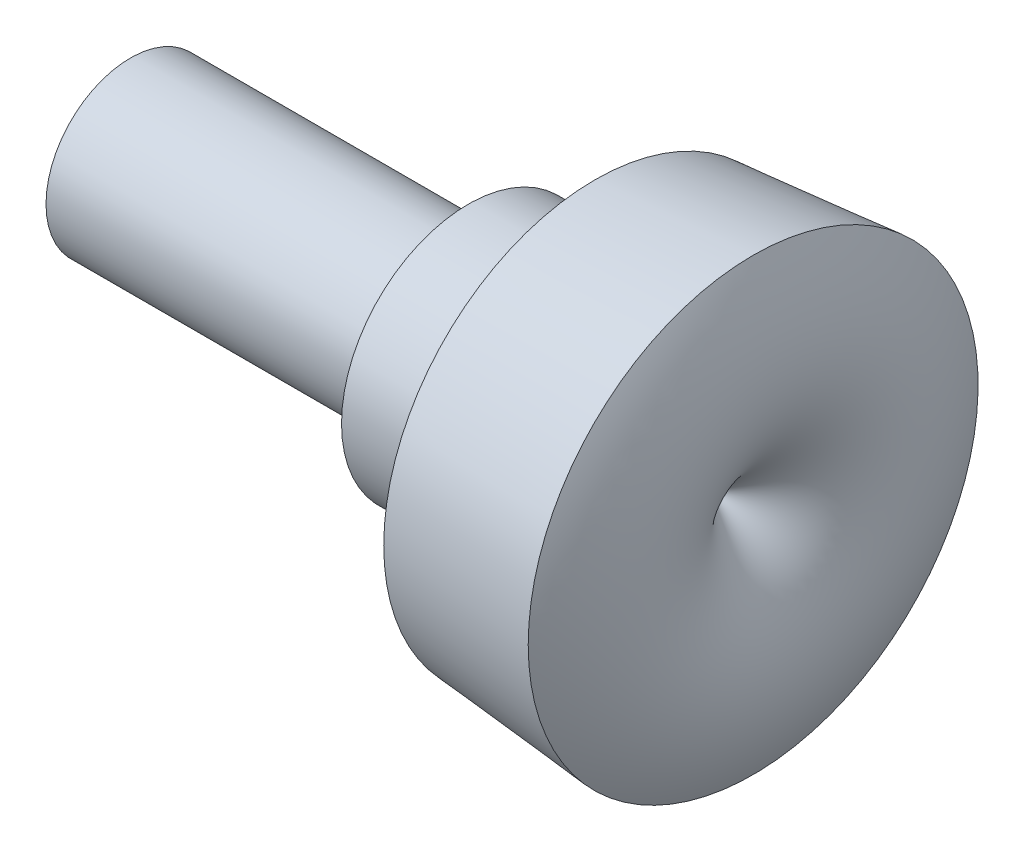
ISO-10303-21;
HEADER;
FILE_DESCRIPTION(('STEP AP214'),'2;1');
FILE_NAME('part.step','',(''),(''),'','','');
FILE_SCHEMA(('AUTOMOTIVE_DESIGN { 1 0 10303 214 1 1 1 1 }'));
ENDSEC;
DATA;
#1=APPLICATION_CONTEXT('core data for automotive mechanical design processes');
#2=APPLICATION_PROTOCOL_DEFINITION('international standard','automotive_design',2000,#1);
#3=PRODUCT_CONTEXT('',#1,'mechanical');
#4=PRODUCT('Part','Part','',(#3));
#5=PRODUCT_RELATED_PRODUCT_CATEGORY('part','',(#4));
#6=PRODUCT_DEFINITION_FORMATION('','',#4);
#7=PRODUCT_DEFINITION_CONTEXT('part definition',#1,'design');
#8=PRODUCT_DEFINITION('design','',#6,#7);
#9=PRODUCT_DEFINITION_SHAPE('','',#8);
#10=(LENGTH_UNIT() NAMED_UNIT(*) SI_UNIT(.MILLI.,.METRE.));
#11=(NAMED_UNIT(*) PLANE_ANGLE_UNIT() SI_UNIT($,.RADIAN.));
#12=(NAMED_UNIT(*) SI_UNIT($,.STERADIAN.) SOLID_ANGLE_UNIT());
#13=UNCERTAINTY_MEASURE_WITH_UNIT(LENGTH_MEASURE(1.E-05),#10,'distance_accuracy_value','');
#14=(GEOMETRIC_REPRESENTATION_CONTEXT(3) GLOBAL_UNCERTAINTY_ASSIGNED_CONTEXT((#13)) GLOBAL_UNIT_ASSIGNED_CONTEXT((#10,
#11,#12)) REPRESENTATION_CONTEXT('',''));
#15=CARTESIAN_POINT('',(0.,0.,0.));
#16=DIRECTION('',(0.,0.,1.));
#17=DIRECTION('',(1.,0.,0.));
#18=AXIS2_PLACEMENT_3D('',#15,#16,#17);
#19=CARTESIAN_POINT('',(13.75,0.,0.));
#20=CARTESIAN_POINT('',(16.478433803921,2.10117274694767,0.));
#21=CARTESIAN_POINT('',(14.75,5.3280824882222,0.));
#22=B_SPLINE_CURVE_WITH_KNOTS('',2,(#19,#20,#21),.UNSPECIFIED.,.F.,.F.,(3,3),(0.,1.),.UNSPECIFIED.);
#23=CARTESIAN_POINT('',(0.,0.,0.));
#24=DIRECTION('',(-1.,0.,0.));
#25=AXIS1_PLACEMENT('',#23,#24);
#26=SURFACE_OF_REVOLUTION('',#22,#25);
#27=CARTESIAN_POINT('',(14.75,0.,0.));
#28=DIRECTION('',(-1.,0.,0.));
#29=DIRECTION('',(0.,0.,1.));
#30=AXIS2_PLACEMENT_3D('',#27,#28,#29);
#31=CIRCLE('',#30,5.3280824882222);
#32=CARTESIAN_POINT('',(14.75,0.,5.3280824882222));
#33=VERTEX_POINT('',#32);
#34=EDGE_CURVE('E11',#33,#33,#31,.T.);
#35=ORIENTED_EDGE('',*,*,#34,.F.);
#36=EDGE_LOOP('',(#35));
#37=FACE_BOUND('',#36,.T.);
#38=CARTESIAN_POINT('',(13.75,0.,0.));
#39=VERTEX_POINT('',#38);
#40=VERTEX_LOOP('',#39);
#41=FACE_BOUND('',#40,.T.);
#42=ADVANCED_FACE('F32',(#37,#41),#26,.T.);
#43=CARTESIAN_POINT('',(14.75,0.,0.));
#44=DIRECTION('',(1.,0.,0.));
#45=DIRECTION('',(0.,0.,-1.));
#46=AXIS2_PLACEMENT_3D('',#43,#44,#45);
#47=CONICAL_SURFACE('',#46,5.3280824882222,0.0872664625997132);
#48=CARTESIAN_POINT('',(11.,0.,0.));
#49=DIRECTION('',(-1.,0.,0.));
#50=DIRECTION('',(0.,0.,1.));
#51=AXIS2_PLACEMENT_3D('',#48,#49,#50);
#52=CIRCLE('',#51,5.);
#53=CARTESIAN_POINT('',(11.,0.,5.));
#54=VERTEX_POINT('',#53);
#55=EDGE_CURVE('E39',#54,#54,#52,.T.);
#56=ORIENTED_EDGE('',*,*,#55,.F.);
#57=EDGE_LOOP('',(#56));
#58=FACE_BOUND('',#57,.T.);
#59=ORIENTED_EDGE('',*,*,#34,.T.);
#60=EDGE_LOOP('',(#59));
#61=FACE_BOUND('',#60,.T.);
#62=ADVANCED_FACE('F43',(#58,#61),#47,.T.);
#63=CARTESIAN_POINT('',(11.,3.,0.));
#64=DIRECTION('',(1.,0.,0.));
#65=DIRECTION('',(0.,0.,-1.));
#66=AXIS2_PLACEMENT_3D('',#63,#64,#65);
#67=PLANE('',#66);
#68=CARTESIAN_POINT('',(11.,0.,0.));
#69=DIRECTION('',(-1.,0.,0.));
#70=DIRECTION('',(0.,0.,1.));
#71=AXIS2_PLACEMENT_3D('',#68,#69,#70);
#72=CIRCLE('',#71,3.);
#73=CARTESIAN_POINT('',(11.,0.,3.));
#74=VERTEX_POINT('',#73);
#75=EDGE_CURVE('E90',#74,#74,#72,.T.);
#76=ORIENTED_EDGE('',*,*,#75,.F.);
#77=EDGE_LOOP('',(#76));
#78=FACE_BOUND('',#77,.T.);
#79=ORIENTED_EDGE('',*,*,#55,.T.);
#80=EDGE_LOOP('',(#79));
#81=FACE_BOUND('',#80,.T.);
#82=ADVANCED_FACE('F48',(#78,#81),#67,.F.);
#83=CARTESIAN_POINT('',(0.,0.,0.));
#84=DIRECTION('',(-1.,0.,0.));
#85=DIRECTION('',(0.,0.,1.));
#86=AXIS2_PLACEMENT_3D('',#83,#84,#85);
#87=CYLINDRICAL_SURFACE('',#86,3.);
#88=CARTESIAN_POINT('',(8.,0.,0.));
#89=DIRECTION('',(-1.,0.,0.));
#90=DIRECTION('',(0.,0.,1.));
#91=AXIS2_PLACEMENT_3D('',#88,#89,#90);
#92=CIRCLE('',#91,3.);
#93=CARTESIAN_POINT('',(8.,0.,3.));
#94=VERTEX_POINT('',#93);
#95=EDGE_CURVE('E82',#94,#94,#92,.T.);
#96=ORIENTED_EDGE('',*,*,#95,.F.);
#97=EDGE_LOOP('',(#96));
#98=FACE_BOUND('',#97,.T.);
#99=ORIENTED_EDGE('',*,*,#75,.T.);
#100=EDGE_LOOP('',(#99));
#101=FACE_BOUND('',#100,.T.);
#102=ADVANCED_FACE('F55',(#98,#101),#87,.T.);
#103=CARTESIAN_POINT('',(8.,2.,0.));
#104=DIRECTION('',(1.,0.,0.));
#105=DIRECTION('',(0.,0.,-1.));
#106=AXIS2_PLACEMENT_3D('',#103,#104,#105);
#107=PLANE('',#106);
#108=CARTESIAN_POINT('',(8.00000000000001,0.,0.));
#109=DIRECTION('',(-1.,0.,0.));
#110=DIRECTION('',(0.,0.,1.));
#111=AXIS2_PLACEMENT_3D('',#108,#109,#110);
#112=CIRCLE('',#111,2.);
#113=CARTESIAN_POINT('',(8.00000000000001,0.,2.));
#114=VERTEX_POINT('',#113);
#115=EDGE_CURVE('E79',#114,#114,#112,.T.);
#116=ORIENTED_EDGE('',*,*,#115,.F.);
#117=EDGE_LOOP('',(#116));
#118=FACE_BOUND('',#117,.T.);
#119=ORIENTED_EDGE('',*,*,#95,.T.);
#120=EDGE_LOOP('',(#119));
#121=FACE_BOUND('',#120,.T.);
#122=ADVANCED_FACE('F62',(#118,#121),#107,.F.);
#123=CARTESIAN_POINT('',(0.,0.,0.));
#124=DIRECTION('',(-1.,0.,0.));
#125=DIRECTION('',(0.,0.,1.));
#126=AXIS2_PLACEMENT_3D('',#123,#124,#125);
#127=CYLINDRICAL_SURFACE('',#126,2.);
#128=CARTESIAN_POINT('',(0.,0.,0.));
#129=DIRECTION('',(-1.,0.,0.));
#130=DIRECTION('',(0.,0.,1.));
#131=AXIS2_PLACEMENT_3D('',#128,#129,#130);
#132=CIRCLE('',#131,2.);
#133=CARTESIAN_POINT('',(0.,0.,2.));
#134=VERTEX_POINT('',#133);
#135=EDGE_CURVE('E78',#134,#134,#132,.T.);
#136=ORIENTED_EDGE('',*,*,#135,.F.);
#137=EDGE_LOOP('',(#136));
#138=FACE_BOUND('',#137,.T.);
#139=ORIENTED_EDGE('',*,*,#115,.T.);
#140=EDGE_LOOP('',(#139));
#141=FACE_BOUND('',#140,.T.);
#142=ADVANCED_FACE('F66',(#138,#141),#127,.T.);
#143=CARTESIAN_POINT('',(0.,0.,0.));
#144=DIRECTION('',(1.,0.,0.));
#145=DIRECTION('',(0.,0.,-1.));
#146=AXIS2_PLACEMENT_3D('',#143,#144,#145);
#147=PLANE('',#146);
#148=ORIENTED_EDGE('',*,*,#135,.T.);
#149=EDGE_LOOP('',(#148));
#150=FACE_BOUND('',#149,.T.);
#151=ADVANCED_FACE('F70',(#150),#147,.F.);
#152=CLOSED_SHELL('',(#42,#62,#82,#102,#122,#142,#151));
#153=MANIFOLD_SOLID_BREP('B2',#152);
#154=ADVANCED_BREP_SHAPE_REPRESENTATION('',(#18,#153),#14);
#155=SHAPE_DEFINITION_REPRESENTATION(#9,#154);
ENDSEC;
END-ISO-10303-21;
